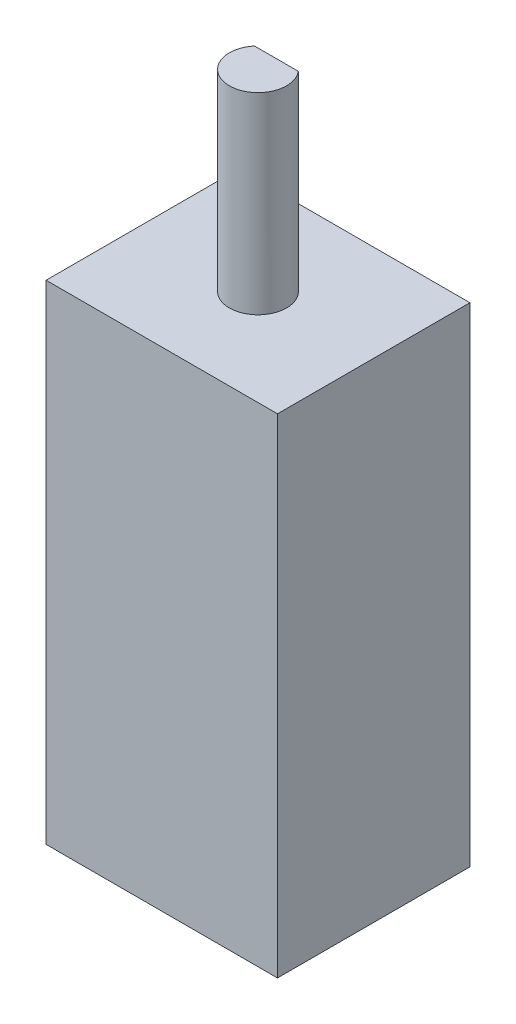
ISO-10303-21;
HEADER;
FILE_DESCRIPTION(('STEP AP214'),'2;1');
FILE_NAME('part.step','',(''),(''),'','','');
FILE_SCHEMA(('AUTOMOTIVE_DESIGN { 1 0 10303 214 1 1 1 1 }'));
ENDSEC;
DATA;
#1=APPLICATION_CONTEXT('core data for automotive mechanical design processes');
#2=APPLICATION_PROTOCOL_DEFINITION('international standard','automotive_design',2000,#1);
#3=PRODUCT_CONTEXT('',#1,'mechanical');
#4=PRODUCT('Part','Part','',(#3));
#5=PRODUCT_RELATED_PRODUCT_CATEGORY('part','',(#4));
#6=PRODUCT_DEFINITION_FORMATION('','',#4);
#7=PRODUCT_DEFINITION_CONTEXT('part definition',#1,'design');
#8=PRODUCT_DEFINITION('design','',#6,#7);
#9=PRODUCT_DEFINITION_SHAPE('','',#8);
#10=(LENGTH_UNIT() NAMED_UNIT(*) SI_UNIT(.MILLI.,.METRE.));
#11=(NAMED_UNIT(*) PLANE_ANGLE_UNIT() SI_UNIT($,.RADIAN.));
#12=(NAMED_UNIT(*) SI_UNIT($,.STERADIAN.) SOLID_ANGLE_UNIT());
#13=UNCERTAINTY_MEASURE_WITH_UNIT(LENGTH_MEASURE(1.E-05),#10,'distance_accuracy_value','');
#14=(GEOMETRIC_REPRESENTATION_CONTEXT(3) GLOBAL_UNCERTAINTY_ASSIGNED_CONTEXT((#13)) GLOBAL_UNIT_ASSIGNED_CONTEXT((#10,
#11,#12)) REPRESENTATION_CONTEXT('',''));
#15=CARTESIAN_POINT('',(0.,0.,0.));
#16=DIRECTION('',(0.,0.,1.));
#17=DIRECTION('',(1.,0.,0.));
#18=AXIS2_PLACEMENT_3D('',#15,#16,#17);
#19=CARTESIAN_POINT('',(0.,0.,10.033));
#20=DIRECTION('',(1.,0.,0.));
#21=DIRECTION('',(0.,0.,-1.));
#22=AXIS2_PLACEMENT_3D('',#19,#20,#21);
#23=PLANE('',#22);
#24=DIRECTION('',(0.,-1.,0.));
#25=VECTOR('',#24,1.);
#26=CARTESIAN_POINT('',(0.,0.,0.));
#27=LINE('',#26,#25);
#28=CARTESIAN_POINT('',(0.,25.4761999999999,0.));
#29=VERTEX_POINT('',#28);
#30=CARTESIAN_POINT('',(0.,0.,0.));
#31=VERTEX_POINT('',#30);
#32=EDGE_CURVE('E119',#29,#31,#27,.T.);
#33=ORIENTED_EDGE('',*,*,#32,.T.);
#34=DIRECTION('',(0.,0.,-1.));
#35=VECTOR('',#34,1.);
#36=CARTESIAN_POINT('',(0.,0.,10.033));
#37=LINE('',#36,#35);
#38=CARTESIAN_POINT('',(0.,0.,10.033));
#39=VERTEX_POINT('',#38);
#40=EDGE_CURVE('E39',#39,#31,#37,.T.);
#41=ORIENTED_EDGE('',*,*,#40,.F.);
#42=DIRECTION('',(0.,-1.,0.));
#43=VECTOR('',#42,1.);
#44=CARTESIAN_POINT('',(0.,0.,10.033));
#45=LINE('',#44,#43);
#46=CARTESIAN_POINT('',(0.,25.4761999999999,10.033));
#47=VERTEX_POINT('',#46);
#48=EDGE_CURVE('E121',#47,#39,#45,.T.);
#49=ORIENTED_EDGE('',*,*,#48,.F.);
#50=DIRECTION('',(0.,0.,-1.));
#51=VECTOR('',#50,1.);
#52=CARTESIAN_POINT('',(0.,25.4761999999999,10.033));
#53=LINE('',#52,#51);
#54=EDGE_CURVE('E127',#47,#29,#53,.T.);
#55=ORIENTED_EDGE('',*,*,#54,.T.);
#56=EDGE_LOOP('',(#33,#41,#49,#55));
#57=FACE_BOUND('',#56,.T.);
#58=ADVANCED_FACE('F36',(#57),#23,.F.);
#59=CARTESIAN_POINT('',(0.,0.,10.033));
#60=DIRECTION('',(0.,1.,0.));
#61=DIRECTION('',(0.,0.,1.));
#62=AXIS2_PLACEMENT_3D('',#59,#60,#61);
#63=PLANE('',#62);
#64=DIRECTION('',(1.,0.,0.));
#65=VECTOR('',#64,1.);
#66=CARTESIAN_POINT('',(0.,0.,0.));
#67=LINE('',#66,#65);
#68=CARTESIAN_POINT('',(12.065,0.,0.));
#69=VERTEX_POINT('',#68);
#70=EDGE_CURVE('E130',#31,#69,#67,.T.);
#71=ORIENTED_EDGE('',*,*,#70,.T.);
#72=DIRECTION('',(0.,0.,-1.));
#73=VECTOR('',#72,1.);
#74=CARTESIAN_POINT('',(12.065,0.,10.033));
#75=LINE('',#74,#73);
#76=CARTESIAN_POINT('',(12.065,0.,10.033));
#77=VERTEX_POINT('',#76);
#78=EDGE_CURVE('E137',#77,#69,#75,.T.);
#79=ORIENTED_EDGE('',*,*,#78,.F.);
#80=DIRECTION('',(1.,0.,0.));
#81=VECTOR('',#80,1.);
#82=CARTESIAN_POINT('',(0.,0.,10.033));
#83=LINE('',#82,#81);
#84=EDGE_CURVE('E89',#39,#77,#83,.T.);
#85=ORIENTED_EDGE('',*,*,#84,.F.);
#86=ORIENTED_EDGE('',*,*,#40,.T.);
#87=EDGE_LOOP('',(#71,#79,#85,#86));
#88=FACE_BOUND('',#87,.T.);
#89=ADVANCED_FACE('F143',(#88),#63,.F.);
#90=CARTESIAN_POINT('',(12.065,0.,10.033));
#91=DIRECTION('',(-1.,0.,0.));
#92=DIRECTION('',(0.,0.,1.));
#93=AXIS2_PLACEMENT_3D('',#90,#91,#92);
#94=PLANE('',#93);
#95=DIRECTION('',(0.,1.,0.));
#96=VECTOR('',#95,1.);
#97=CARTESIAN_POINT('',(12.065,0.,0.));
#98=LINE('',#97,#96);
#99=CARTESIAN_POINT('',(12.065,25.4762000000001,0.));
#100=VERTEX_POINT('',#99);
#101=EDGE_CURVE('E132',#69,#100,#98,.T.);
#102=ORIENTED_EDGE('',*,*,#101,.T.);
#103=DIRECTION('',(0.,0.,-1.));
#104=VECTOR('',#103,1.);
#105=CARTESIAN_POINT('',(12.065,25.4762000000001,10.033));
#106=LINE('',#105,#104);
#107=CARTESIAN_POINT('',(12.065,25.4762000000001,10.033));
#108=VERTEX_POINT('',#107);
#109=EDGE_CURVE('E136',#108,#100,#106,.T.);
#110=ORIENTED_EDGE('',*,*,#109,.F.);
#111=DIRECTION('',(0.,1.,0.));
#112=VECTOR('',#111,1.);
#113=CARTESIAN_POINT('',(12.065,0.,10.033));
#114=LINE('',#113,#112);
#115=EDGE_CURVE('E124',#77,#108,#114,.T.);
#116=ORIENTED_EDGE('',*,*,#115,.F.);
#117=ORIENTED_EDGE('',*,*,#78,.T.);
#118=EDGE_LOOP('',(#102,#110,#116,#117));
#119=FACE_BOUND('',#118,.T.);
#120=ADVANCED_FACE('F150',(#119),#94,.F.);
#121=CARTESIAN_POINT('',(0.,25.4761999999999,10.033));
#122=DIRECTION('',(0.,-1.,0.));
#123=DIRECTION('',(0.,0.,-1.));
#124=AXIS2_PLACEMENT_3D('',#121,#122,#123);
#125=PLANE('',#124);
#126=CARTESIAN_POINT('',(6.0325,25.4762,5.0165));
#127=DIRECTION('',(0.,1.,0.));
#128=DIRECTION('',(0.,0.,1.));
#129=AXIS2_PLACEMENT_3D('',#126,#127,#128);
#130=CIRCLE('',#129,1.49225);
#131=CARTESIAN_POINT('',(6.0325,25.4762,6.50875));
#132=VERTEX_POINT('',#131);
#133=EDGE_CURVE('E11',#132,#132,#130,.T.);
#134=ORIENTED_EDGE('',*,*,#133,.F.);
#135=EDGE_LOOP('',(#134));
#136=FACE_BOUND('',#135,.T.);
#137=DIRECTION('',(-1.,0.,0.));
#138=VECTOR('',#137,1.);
#139=CARTESIAN_POINT('',(0.,25.4761999999999,0.));
#140=LINE('',#139,#138);
#141=EDGE_CURVE('E81',#100,#29,#140,.T.);
#142=ORIENTED_EDGE('',*,*,#141,.T.);
#143=ORIENTED_EDGE('',*,*,#54,.F.);
#144=DIRECTION('',(-1.,0.,0.));
#145=VECTOR('',#144,1.);
#146=CARTESIAN_POINT('',(0.,25.4761999999999,10.033));
#147=LINE('',#146,#145);
#148=EDGE_CURVE('E60',#108,#47,#147,.T.);
#149=ORIENTED_EDGE('',*,*,#148,.F.);
#150=ORIENTED_EDGE('',*,*,#109,.T.);
#151=EDGE_LOOP('',(#142,#143,#149,#150));
#152=FACE_BOUND('',#151,.T.);
#153=ADVANCED_FACE('F151',(#136,#152),#125,.F.);
#154=CARTESIAN_POINT('',(0.,0.,10.033));
#155=DIRECTION('',(0.,0.,-1.));
#156=DIRECTION('',(-1.,0.,0.));
#157=AXIS2_PLACEMENT_3D('',#154,#155,#156);
#158=PLANE('',#157);
#159=ORIENTED_EDGE('',*,*,#48,.T.);
#160=ORIENTED_EDGE('',*,*,#84,.T.);
#161=ORIENTED_EDGE('',*,*,#115,.T.);
#162=ORIENTED_EDGE('',*,*,#148,.T.);
#163=EDGE_LOOP('',(#159,#160,#161,#162));
#164=FACE_BOUND('',#163,.T.);
#165=ADVANCED_FACE('F152',(#164),#158,.F.);
#166=CARTESIAN_POINT('',(0.,0.,0.));
#167=DIRECTION('',(0.,0.,-1.));
#168=DIRECTION('',(-1.,0.,0.));
#169=AXIS2_PLACEMENT_3D('',#166,#167,#168);
#170=PLANE('',#169);
#171=ORIENTED_EDGE('',*,*,#32,.F.);
#172=ORIENTED_EDGE('',*,*,#141,.F.);
#173=ORIENTED_EDGE('',*,*,#101,.F.);
#174=ORIENTED_EDGE('',*,*,#70,.F.);
#175=EDGE_LOOP('',(#171,#172,#173,#174));
#176=FACE_BOUND('',#175,.T.);
#177=ADVANCED_FACE('F148',(#176),#170,.T.);
#178=CARTESIAN_POINT('',(6.0325,35.5092,5.0165));
#179=DIRECTION('',(0.,-1.,0.));
#180=DIRECTION('',(0.,0.,-1.));
#181=AXIS2_PLACEMENT_3D('',#178,#179,#180);
#182=CYLINDRICAL_SURFACE('',#181,1.49225);
#183=CARTESIAN_POINT('',(6.0325,35.5092,5.0165));
#184=DIRECTION('',(0.,1.,0.));
#185=DIRECTION('',(0.,0.,1.));
#186=AXIS2_PLACEMENT_3D('',#183,#184,#185);
#187=CIRCLE('',#186,1.49225);
#188=CARTESIAN_POINT('',(4.89014294193978,35.5092,4.05638));
#189=VERTEX_POINT('',#188);
#190=CARTESIAN_POINT('',(7.17485705806022,35.5092,4.05638));
#191=VERTEX_POINT('',#190);
#192=EDGE_CURVE('E114',#189,#191,#187,.T.);
#193=ORIENTED_EDGE('',*,*,#192,.F.);
#194=DIRECTION('',(0.,1.,0.));
#195=VECTOR('',#194,1.);
#196=CARTESIAN_POINT('',(4.89014294193978,26.8986000000001,4.05638));
#197=LINE('',#196,#195);
#198=CARTESIAN_POINT('',(4.89014294193978,26.8986000000001,4.05638));
#199=VERTEX_POINT('',#198);
#200=EDGE_CURVE('E51',#199,#189,#197,.T.);
#201=ORIENTED_EDGE('',*,*,#200,.F.);
#202=CARTESIAN_POINT('',(6.0325,26.8986000000001,5.0165));
#203=DIRECTION('',(0.,1.,0.));
#204=DIRECTION('',(0.,0.,1.));
#205=AXIS2_PLACEMENT_3D('',#202,#203,#204);
#206=CIRCLE('',#205,1.49225);
#207=CARTESIAN_POINT('',(7.17485705806022,26.8986000000001,4.05638));
#208=VERTEX_POINT('',#207);
#209=EDGE_CURVE('E100',#208,#199,#206,.T.);
#210=ORIENTED_EDGE('',*,*,#209,.F.);
#211=DIRECTION('',(0.,1.,0.));
#212=VECTOR('',#211,1.);
#213=CARTESIAN_POINT('',(7.17485705806022,26.8986000000001,4.05638));
#214=LINE('',#213,#212);
#215=EDGE_CURVE('E108',#208,#191,#214,.T.);
#216=ORIENTED_EDGE('',*,*,#215,.T.);
#217=EDGE_LOOP('',(#193,#201,#210,#216));
#218=FACE_BOUND('',#217,.T.);
#219=ORIENTED_EDGE('',*,*,#133,.T.);
#220=EDGE_LOOP('',(#219));
#221=FACE_BOUND('',#220,.T.);
#222=ADVANCED_FACE('F111',(#218,#221),#182,.T.);
#223=CARTESIAN_POINT('',(6.0325,35.5092,5.0165));
#224=DIRECTION('',(0.,1.,0.));
#225=DIRECTION('',(0.,0.,1.));
#226=AXIS2_PLACEMENT_3D('',#223,#224,#225);
#227=PLANE('',#226);
#228=DIRECTION('',(1.,0.,0.));
#229=VECTOR('',#228,1.);
#230=CARTESIAN_POINT('',(4.89014294193978,35.5092,4.05638));
#231=LINE('',#230,#229);
#232=EDGE_CURVE('E105',#189,#191,#231,.T.);
#233=ORIENTED_EDGE('',*,*,#232,.F.);
#234=ORIENTED_EDGE('',*,*,#192,.T.);
#235=EDGE_LOOP('',(#233,#234));
#236=FACE_BOUND('',#235,.T.);
#237=ADVANCED_FACE('F196',(#236),#227,.T.);
#238=CARTESIAN_POINT('',(4.89014294193978,26.8986000000001,4.05638));
#239=DIRECTION('',(0.,0.,1.));
#240=DIRECTION('',(1.,0.,0.));
#241=AXIS2_PLACEMENT_3D('',#238,#239,#240);
#242=PLANE('',#241);
#243=ORIENTED_EDGE('',*,*,#232,.T.);
#244=ORIENTED_EDGE('',*,*,#215,.F.);
#245=DIRECTION('',(1.,0.,0.));
#246=VECTOR('',#245,1.);
#247=CARTESIAN_POINT('',(4.89014294193978,26.8986000000001,4.05638));
#248=LINE('',#247,#246);
#249=EDGE_CURVE('E102',#199,#208,#248,.T.);
#250=ORIENTED_EDGE('',*,*,#249,.F.);
#251=ORIENTED_EDGE('',*,*,#200,.T.);
#252=EDGE_LOOP('',(#243,#244,#250,#251));
#253=FACE_BOUND('',#252,.T.);
#254=ADVANCED_FACE('F107',(#253),#242,.F.);
#255=CARTESIAN_POINT('',(6.0325,26.8986000000001,5.0165));
#256=DIRECTION('',(0.,1.,0.));
#257=DIRECTION('',(0.,0.,1.));
#258=AXIS2_PLACEMENT_3D('',#255,#256,#257);
#259=PLANE('',#258);
#260=ORIENTED_EDGE('',*,*,#209,.T.);
#261=ORIENTED_EDGE('',*,*,#249,.T.);
#262=EDGE_LOOP('',(#260,#261));
#263=FACE_BOUND('',#262,.T.);
#264=ADVANCED_FACE('F101',(#263),#259,.T.);
#265=CLOSED_SHELL('',(#58,#89,#120,#153,#165,#177,#222,#237,#254,#264));
#266=MANIFOLD_SOLID_BREP('B2',#265);
#267=ADVANCED_BREP_SHAPE_REPRESENTATION('',(#18,#266),#14);
#268=SHAPE_DEFINITION_REPRESENTATION(#9,#267);
ENDSEC;
END-ISO-10303-21;
